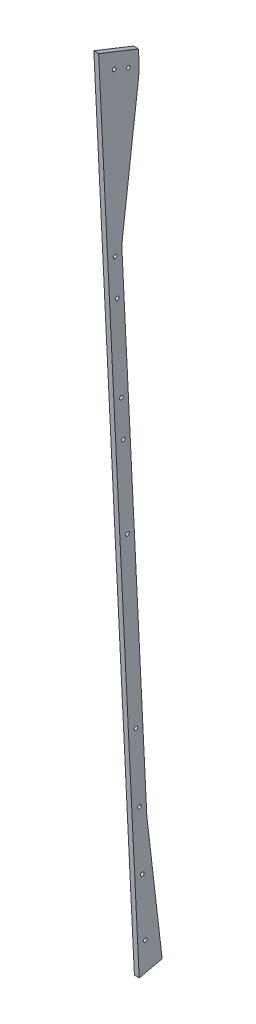
ISO-10303-21;
HEADER;
FILE_DESCRIPTION(('STEP AP214'),'2;1');
FILE_NAME('part.step','',(''),(''),'','','');
FILE_SCHEMA(('AUTOMOTIVE_DESIGN { 1 0 10303 214 1 1 1 1 }'));
ENDSEC;
DATA;
#1=APPLICATION_CONTEXT('core data for automotive mechanical design processes');
#2=APPLICATION_PROTOCOL_DEFINITION('international standard','automotive_design',2000,#1);
#3=PRODUCT_CONTEXT('',#1,'mechanical');
#4=PRODUCT('Part','Part','',(#3));
#5=PRODUCT_RELATED_PRODUCT_CATEGORY('part','',(#4));
#6=PRODUCT_DEFINITION_FORMATION('','',#4);
#7=PRODUCT_DEFINITION_CONTEXT('part definition',#1,'design');
#8=PRODUCT_DEFINITION('design','',#6,#7);
#9=PRODUCT_DEFINITION_SHAPE('','',#8);
#10=(LENGTH_UNIT() NAMED_UNIT(*) SI_UNIT(.MILLI.,.METRE.));
#11=(NAMED_UNIT(*) PLANE_ANGLE_UNIT() SI_UNIT($,.RADIAN.));
#12=(NAMED_UNIT(*) SI_UNIT($,.STERADIAN.) SOLID_ANGLE_UNIT());
#13=UNCERTAINTY_MEASURE_WITH_UNIT(LENGTH_MEASURE(1.E-05),#10,'distance_accuracy_value','');
#14=(GEOMETRIC_REPRESENTATION_CONTEXT(3) GLOBAL_UNCERTAINTY_ASSIGNED_CONTEXT((#13)) GLOBAL_UNIT_ASSIGNED_CONTEXT((#10,
#11,#12)) REPRESENTATION_CONTEXT('',''));
#15=CARTESIAN_POINT('',(0.,0.,0.));
#16=DIRECTION('',(0.,0.,1.));
#17=DIRECTION('',(1.,0.,0.));
#18=AXIS2_PLACEMENT_3D('',#15,#16,#17);
#19=CARTESIAN_POINT('',(330.833532998339,6328.56471667294,3286.55838001129));
#20=DIRECTION('',(-0.999638800759929,0.0267996972431761,0.00201103031422804));
#21=DIRECTION('',(-0.0267997514355835,-0.999640822157134,0.));
#22=AXIS2_PLACEMENT_3D('',#19,#20,#21);
#23=PLANE('',#22);
#24=CARTESIAN_POINT('',(345.118144193122,6858.71025908507,3322.21750066347));
#25=DIRECTION('',(-0.999638800759929,0.0267996972431761,0.00201103031422804));
#26=DIRECTION('',(-0.0267997514355835,-0.999640822157134,0.));
#27=AXIS2_PLACEMENT_3D('',#24,#25,#26);
#28=CIRCLE('',#27,4.21640000000019);
#29=CARTESIAN_POINT('',(345.005145721169,6854.49537352252,3322.21750066347));
#30=VERTEX_POINT('',#29);
#31=EDGE_CURVE('E674',#30,#30,#28,.T.);
#32=ORIENTED_EDGE('',*,*,#31,.F.);
#33=EDGE_LOOP('',(#32));
#34=FACE_BOUND('',#33,.T.);
#35=CARTESIAN_POINT('',(344.873476967481,6851.01357504661,3303.16753918493));
#36=DIRECTION('',(-0.999638800759929,0.0267996972431761,0.00201103031422804));
#37=DIRECTION('',(-0.0267997514355835,-0.999640822157134,0.));
#38=AXIS2_PLACEMENT_3D('',#35,#36,#37);
#39=CIRCLE('',#38,4.21640000000019);
#40=CARTESIAN_POINT('',(344.760478495528,6846.79868948406,3303.16753918493));
#41=VERTEX_POINT('',#40);
#42=EDGE_CURVE('E281',#41,#41,#39,.T.);
#43=ORIENTED_EDGE('',*,*,#42,.F.);
#44=EDGE_LOOP('',(#43));
#45=FACE_BOUND('',#44,.T.);
#46=CARTESIAN_POINT('',(339.165717767339,6637.23527592942,3314.85116795923));
#47=DIRECTION('',(-0.999638800759929,0.0267996972431761,0.00201103031422804));
#48=DIRECTION('',(-0.0267997514355835,-0.999640822157134,0.));
#49=AXIS2_PLACEMENT_3D('',#46,#47,#48);
#50=CIRCLE('',#49,4.21640000000019);
#51=CARTESIAN_POINT('',(339.052719295386,6633.02039036688,3314.85116795923));
#52=VERTEX_POINT('',#51);
#53=EDGE_CURVE('E274',#52,#52,#50,.T.);
#54=ORIENTED_EDGE('',*,*,#53,.F.);
#55=EDGE_LOOP('',(#54));
#56=FACE_BOUND('',#55,.T.);
#57=CARTESIAN_POINT('',(337.79643987231,6586.44668000312,3311.04002766538));
#58=DIRECTION('',(-0.999638800759929,0.0267996972431761,0.00201103031422804));
#59=DIRECTION('',(-0.0267997514355835,-0.999640822157134,0.));
#60=AXIS2_PLACEMENT_3D('',#57,#58,#59);
#61=CIRCLE('',#60,4.21640000000019);
#62=CARTESIAN_POINT('',(337.683441400357,6582.23179444058,3311.04002766538));
#63=VERTEX_POINT('',#62);
#64=EDGE_CURVE('E270',#63,#63,#61,.T.);
#65=ORIENTED_EDGE('',*,*,#64,.F.);
#66=EDGE_LOOP('',(#65));
#67=FACE_BOUND('',#66,.T.);
#68=CARTESIAN_POINT('',(334.559117433361,6466.36947592941,3302.02951925376));
#69=DIRECTION('',(-0.999638800759929,0.0267996972431761,0.00201103031422804));
#70=DIRECTION('',(-0.0267997514355835,-0.999640822157134,0.));
#71=AXIS2_PLACEMENT_3D('',#68,#69,#70);
#72=CIRCLE('',#71,4.21640000000019);
#73=CARTESIAN_POINT('',(334.446118961408,6462.15459036687,3302.02951925376));
#74=VERTEX_POINT('',#73);
#75=EDGE_CURVE('E266',#74,#74,#72,.T.);
#76=ORIENTED_EDGE('',*,*,#75,.F.);
#77=EDGE_LOOP('',(#76));
#78=FACE_BOUND('',#77,.T.);
#79=CARTESIAN_POINT('',(333.189839538871,6415.58088002313,3298.21837896142));
#80=DIRECTION('',(-0.999638800759929,0.0267996972431761,0.00201103031422804));
#81=DIRECTION('',(-0.0267997514355835,-0.999640822157134,0.));
#82=AXIS2_PLACEMENT_3D('',#79,#80,#81);
#83=CIRCLE('',#82,4.21640000000019);
#84=CARTESIAN_POINT('',(333.076841066918,6411.36599446059,3298.21837896142));
#85=VERTEX_POINT('',#84);
#86=EDGE_CURVE('E260',#85,#85,#83,.T.);
#87=ORIENTED_EDGE('',*,*,#86,.F.);
#88=EDGE_LOOP('',(#87));
#89=FACE_BOUND('',#88,.T.);
#90=CARTESIAN_POINT('',(330.107965047175,6301.2694763098,3289.64053212822));
#91=DIRECTION('',(-0.999638800759929,0.0267996972431761,0.00201103031422804));
#92=DIRECTION('',(-0.0267997514355835,-0.999640822157134,0.));
#93=AXIS2_PLACEMENT_3D('',#90,#91,#92);
#94=CIRCLE('',#93,4.21640000000019);
#95=CARTESIAN_POINT('',(329.994966575222,6297.05459074726,3289.64053212822));
#96=VERTEX_POINT('',#95);
#97=EDGE_CURVE('E254',#96,#96,#94,.T.);
#98=ORIENTED_EDGE('',*,*,#97,.F.);
#99=EDGE_LOOP('',(#98));
#100=FACE_BOUND('',#99,.T.);
#101=CARTESIAN_POINT('',(323.773940239033,6066.33088003518,3272.01090613637));
#102=DIRECTION('',(-0.999638800759929,0.0267996972431761,0.00201103031422804));
#103=DIRECTION('',(-0.0267997514355835,-0.999640822157134,0.));
#104=AXIS2_PLACEMENT_3D('',#101,#102,#103);
#105=CIRCLE('',#104,4.21640000000019);
#106=CARTESIAN_POINT('',(323.66094176708,6062.11599447264,3272.01090613637));
#107=VERTEX_POINT('',#106);
#108=EDGE_CURVE('E248',#107,#107,#105,.T.);
#109=ORIENTED_EDGE('',*,*,#108,.F.);
#110=EDGE_LOOP('',(#109));
#111=FACE_BOUND('',#110,.T.);
#112=CARTESIAN_POINT('',(321.205660263431,5971.06947664874,3264.86255784549));
#113=DIRECTION('',(-0.999638800759929,0.0267996972431761,0.00201103031422804));
#114=DIRECTION('',(-0.0267997514355835,-0.999640822157134,0.));
#115=AXIS2_PLACEMENT_3D('',#112,#113,#114);
#116=CIRCLE('',#115,4.21640000000019);
#117=CARTESIAN_POINT('',(321.092661791478,5966.8545910862,3264.86255784549));
#118=VERTEX_POINT('',#117);
#119=EDGE_CURVE('E242',#118,#118,#116,.T.);
#120=ORIENTED_EDGE('',*,*,#119,.F.);
#121=EDGE_LOOP('',(#120));
#122=FACE_BOUND('',#121,.T.);
#123=CARTESIAN_POINT('',(319.008412287028,5889.57021340304,3258.7469108109));
#124=DIRECTION('',(-0.999638800759929,0.0267996972431761,0.00201103031422804));
#125=DIRECTION('',(-0.0267997514355835,-0.999640822157134,0.));
#126=AXIS2_PLACEMENT_3D('',#123,#124,#125);
#127=CIRCLE('',#126,4.21640000000019);
#128=CARTESIAN_POINT('',(318.895413815075,5885.3553278405,3258.7469108109));
#129=VERTEX_POINT('',#128);
#130=EDGE_CURVE('E236',#129,#129,#127,.T.);
#131=ORIENTED_EDGE('',*,*,#130,.F.);
#132=EDGE_LOOP('',(#131));
#133=FACE_BOUND('',#132,.T.);
#134=CARTESIAN_POINT('',(316.858408729451,5809.82331737681,3252.76276017221));
#135=DIRECTION('',(-0.999638800759929,0.0267996972431761,0.00201103031422804));
#136=DIRECTION('',(-0.0267997514355835,-0.999640822157134,0.));
#137=AXIS2_PLACEMENT_3D('',#134,#135,#136);
#138=CIRCLE('',#137,4.21640000000019);
#139=CARTESIAN_POINT('',(316.745410257498,5805.60843181427,3252.76276017221));
#140=VERTEX_POINT('',#139);
#141=EDGE_CURVE('E230',#140,#140,#138,.T.);
#142=ORIENTED_EDGE('',*,*,#141,.F.);
#143=EDGE_LOOP('',(#142));
#144=FACE_BOUND('',#143,.T.);
#145=DIRECTION('',(-0.0268750444697445,-0.996836200329252,-0.0748018829835693));
#146=VECTOR('',#145,1.);
#147=CARTESIAN_POINT('',(345.257711916951,6866.31808677679,3290.20894948043));
#148=LINE('',#147,#146);
#149=CARTESIAN_POINT('',(345.257711916951,6866.31808677679,3290.20894948043));
#150=VERTEX_POINT('',#149);
#151=CARTESIAN_POINT('',(344.862153269152,6851.64621600378,3289.10798268132));
#152=VERTEX_POINT('',#151);
#153=EDGE_CURVE('E172',#150,#152,#148,.T.);
#154=ORIENTED_EDGE('',*,*,#153,.T.);
#155=CARTESIAN_POINT('',(344.862153269152,6842.14294429035,3415.75192381843));
#156=DIRECTION('',(-0.999638800759929,0.0267996972431761,0.00201103031422804));
#157=DIRECTION('',(-0.0267997514355835,-0.999640822157134,0.));
#158=AXIS2_PLACEMENT_3D('',#155,#156,#157);
#159=CIRCLE('',#158,127.);
#160=CARTESIAN_POINT('',(344.2920511811,6830.3667570707,3289.30036630261));
#161=VERTEX_POINT('',#160);
#162=EDGE_CURVE('E61',#152,#161,#159,.T.);
#163=ORIENTED_EDGE('',*,*,#162,.T.);
#164=DIRECTION('',(-0.0264974896682468,-0.995330943322221,0.0928126947490465));
#165=VECTOR('',#164,1.);
#166=CARTESIAN_POINT('',(344.575085787419,6840.99844728843,3288.30898165264));
#167=LINE('',#166,#165);
#168=CARTESIAN_POINT('',(339.676212974387,6656.98102679845,3305.46825193458));
#169=VERTEX_POINT('',#168);
#170=EDGE_CURVE('E337',#161,#169,#167,.T.);
#171=ORIENTED_EDGE('',*,*,#170,.T.);
#172=CARTESIAN_POINT('',(339.106110886335,6645.20483957881,3179.01669441876));
#173=DIRECTION('',(-0.999638800759929,0.0267996972431761,0.00201103031422804));
#174=DIRECTION('',(-0.0267997514355835,-0.999640822157134,0.));
#175=AXIS2_PLACEMENT_3D('',#172,#173,#174);
#176=CIRCLE('',#175,127.);
#177=CARTESIAN_POINT('',(339.106110886336,6635.70156786537,3305.66063555587));
#178=VERTEX_POINT('',#177);
#179=EDGE_CURVE('E53',#169,#178,#176,.F.);
#180=ORIENTED_EDGE('',*,*,#179,.T.);
#181=DIRECTION('',(-0.0268750444697426,-0.996836200329252,-0.0748018829835755));
#182=VECTOR('',#181,1.);
#183=CARTESIAN_POINT('',(320.7592161912,5955.18738987656,3254.5953332587));
#184=LINE('',#183,#182);
#185=CARTESIAN_POINT('',(320.869813105675,5959.28959733959,3254.90316000348));
#186=VERTEX_POINT('',#185);
#187=EDGE_CURVE('E141',#178,#186,#184,.T.);
#188=ORIENTED_EDGE('',*,*,#187,.T.);
#189=CARTESIAN_POINT('',(320.869813105675,5968.79286905303,3128.25921886636));
#190=DIRECTION('',(-0.999638800759929,0.0267996972431761,0.00201103031422804));
#191=DIRECTION('',(-0.0267997514355835,-0.999640822157134,0.));
#192=AXIS2_PLACEMENT_3D('',#189,#190,#191);
#193=CIRCLE('',#192,127.);
#194=CARTESIAN_POINT('',(320.648851281778,5951.11372335362,3254.02248450149));
#195=VERTEX_POINT('',#194);
#196=EDGE_CURVE('E135',#186,#195,#193,.F.);
#197=ORIENTED_EDGE('',*,*,#196,.T.);
#198=DIRECTION('',(-0.0268186672540606,-0.989900753371849,-0.139202218231466));
#199=VECTOR('',#198,1.);
#200=CARTESIAN_POINT('',(315.910060904877,5776.2007748567,3229.42580615243));
#201=LINE('',#200,#199);
#202=CARTESIAN_POINT('',(315.910060904877,5776.2007748567,3229.42580615243));
#203=VERTEX_POINT('',#202);
#204=EDGE_CURVE('E128',#195,#203,#201,.T.);
#205=ORIENTED_EDGE('',*,*,#204,.T.);
#206=DIRECTION('',(0.00407056898783209,0.22494919066946,-0.974361992323834));
#207=VECTOR('',#206,1.);
#208=CARTESIAN_POINT('',(315.783406950661,5769.20158025248,3259.74264872));
#209=LINE('',#208,#207);
#210=CARTESIAN_POINT('',(315.783406950661,5769.20158025248,3259.74264872));
#211=VERTEX_POINT('',#210);
#212=EDGE_CURVE('E132',#211,#203,#209,.T.);
#213=ORIENTED_EDGE('',*,*,#212,.F.);
#214=DIRECTION('',(-0.0268750444697409,-0.996836200329285,-0.0748018829831427));
#215=VECTOR('',#214,1.);
#216=CARTESIAN_POINT('',(345.944605360305,6887.92621916047,3343.69095387015));
#217=LINE('',#216,#215);
#218=CARTESIAN_POINT('',(345.944605360305,6887.92621916047,3343.69095387015));
#219=VERTEX_POINT('',#218);
#220=EDGE_CURVE('E190',#219,#211,#217,.T.);
#221=ORIENTED_EDGE('',*,*,#220,.F.);
#222=DIRECTION('',(0.0119073951331528,0.37458003547832,0.927118121364372));
#223=VECTOR('',#222,1.);
#224=CARTESIAN_POINT('',(345.260705407891,6866.41225531079,3290.44202478092));
#225=LINE('',#224,#223);
#226=EDGE_CURVE('E140',#150,#219,#225,.T.);
#227=ORIENTED_EDGE('',*,*,#226,.F.);
#228=EDGE_LOOP('',(#154,#163,#171,#180,#188,#197,#205,#213,#221,#227));
#229=FACE_BOUND('',#228,.T.);
#230=ADVANCED_FACE('F44',(#34,#45,#56,#67,#78,#89,#100,#111,#122,#133,#144,#229),#23,.T.);
#231=CARTESIAN_POINT('',(315.783406950661,5769.20158025248,3259.74264872));
#232=DIRECTION('',(-0.0265649860411408,-0.974001867475019,-0.224977029209229));
#233=DIRECTION('',(0.,0.225056454223439,-0.974345725301021));
#234=AXIS2_PLACEMENT_3D('',#231,#232,#233);
#235=PLANE('',#234);
#236=ORIENTED_EDGE('',*,*,#212,.T.);
#237=DIRECTION('',(-0.999638800759929,0.0267996972431761,0.00201103031422804));
#238=VECTOR('',#237,1.);
#239=CARTESIAN_POINT('',(1424.96732066379,5746.46763648283,3227.19465249183));
#240=LINE('',#239,#238);
#241=CARTESIAN_POINT('',(322.257767289702,5776.0305967792,3229.41303610994));
#242=VERTEX_POINT('',#241);
#243=EDGE_CURVE('E148',#242,#203,#240,.T.);
#244=ORIENTED_EDGE('',*,*,#243,.F.);
#245=DIRECTION('',(0.00407056898790203,0.224949190669511,-0.974361992323821));
#246=VECTOR('',#245,1.);
#247=CARTESIAN_POINT('',(322.131113335485,5769.03140217498,3259.72987867752));
#248=LINE('',#247,#246);
#249=CARTESIAN_POINT('',(322.131113335485,5769.03140217498,3259.72987867752));
#250=VERTEX_POINT('',#249);
#251=EDGE_CURVE('E173',#250,#242,#248,.T.);
#252=ORIENTED_EDGE('',*,*,#251,.F.);
#253=DIRECTION('',(-0.99963880075992,0.0267996972436962,0.0020110303120063));
#254=VECTOR('',#253,1.);
#255=CARTESIAN_POINT('',(322.131113335484,5769.03140217498,3259.72987867752));
#256=LINE('',#255,#254);
#257=EDGE_CURVE('E149',#250,#211,#256,.T.);
#258=ORIENTED_EDGE('',*,*,#257,.T.);
#259=EDGE_LOOP('',(#236,#244,#252,#258));
#260=FACE_BOUND('',#259,.T.);
#261=ADVANCED_FACE('F146',(#260),#235,.T.);
#262=CARTESIAN_POINT('',(337.18123938317,6328.39453859544,3286.54560996879));
#263=DIRECTION('',(0.999638800759929,-0.0267996972431899,-0.00201103031419884));
#264=DIRECTION('',(0.0267997514355972,0.999640822157134,0.));
#265=AXIS2_PLACEMENT_3D('',#262,#263,#264);
#266=PLANE('',#265);
#267=CARTESIAN_POINT('',(351.46585057796,6858.54008100757,3322.20473062097));
#268=DIRECTION('',(0.999638800759929,-0.0267996972431899,-0.00201103031419884));
#269=DIRECTION('',(0.0267997514355972,0.999640822157134,0.));
#270=AXIS2_PLACEMENT_3D('',#267,#268,#269);
#271=CIRCLE('',#270,2.45745000000005);
#272=CARTESIAN_POINT('',(351.531709627125,6860.99664834598,3322.20473062097));
#273=VERTEX_POINT('',#272);
#274=EDGE_CURVE('E48',#273,#273,#271,.T.);
#275=ORIENTED_EDGE('',*,*,#274,.F.);
#276=EDGE_LOOP('',(#275));
#277=FACE_BOUND('',#276,.T.);
#278=CARTESIAN_POINT('',(351.221183352319,6850.84339696911,3303.15476914244));
#279=DIRECTION('',(0.999638800759929,-0.0267996972431899,-0.00201103031419884));
#280=DIRECTION('',(0.0267997514355972,0.999640822157134,0.));
#281=AXIS2_PLACEMENT_3D('',#278,#279,#280);
#282=CIRCLE('',#281,2.45745000000005);
#283=CARTESIAN_POINT('',(351.287042401484,6853.29996430752,3303.15476914244));
#284=VERTEX_POINT('',#283);
#285=EDGE_CURVE('E272',#284,#284,#282,.T.);
#286=ORIENTED_EDGE('',*,*,#285,.F.);
#287=EDGE_LOOP('',(#286));
#288=FACE_BOUND('',#287,.T.);
#289=CARTESIAN_POINT('',(345.513424152173,6637.06509785193,3314.83839791673));
#290=DIRECTION('',(0.999638800759929,-0.0267996972431899,-0.00201103031419884));
#291=DIRECTION('',(0.0267997514355972,0.999640822157134,0.));
#292=AXIS2_PLACEMENT_3D('',#289,#290,#291);
#293=CIRCLE('',#292,2.45745000000005);
#294=CARTESIAN_POINT('',(345.579283201339,6639.52166519034,3314.83839791673));
#295=VERTEX_POINT('',#294);
#296=EDGE_CURVE('E268',#295,#295,#293,.T.);
#297=ORIENTED_EDGE('',*,*,#296,.F.);
#298=EDGE_LOOP('',(#297));
#299=FACE_BOUND('',#298,.T.);
#300=CARTESIAN_POINT('',(344.144146257144,6586.27650192562,3311.02725762289));
#301=DIRECTION('',(0.999638800759929,-0.0267996972431899,-0.00201103031419884));
#302=DIRECTION('',(0.0267997514355972,0.999640822157134,0.));
#303=AXIS2_PLACEMENT_3D('',#300,#301,#302);
#304=CIRCLE('',#303,2.45745000000005);
#305=CARTESIAN_POINT('',(344.210005306309,6588.73306926404,3311.02725762289));
#306=VERTEX_POINT('',#305);
#307=EDGE_CURVE('E262',#306,#306,#304,.T.);
#308=ORIENTED_EDGE('',*,*,#307,.F.);
#309=EDGE_LOOP('',(#308));
#310=FACE_BOUND('',#309,.T.);
#311=CARTESIAN_POINT('',(340.906823818193,6466.19929785192,3302.01674921127));
#312=DIRECTION('',(0.999638800759929,-0.0267996972431899,-0.00201103031419884));
#313=DIRECTION('',(0.0267997514355972,0.999640822157134,0.));
#314=AXIS2_PLACEMENT_3D('',#311,#312,#313);
#315=CIRCLE('',#314,2.45745000000005);
#316=CARTESIAN_POINT('',(340.972682867359,6468.65586519033,3302.01674921127));
#317=VERTEX_POINT('',#316);
#318=EDGE_CURVE('E256',#317,#317,#315,.T.);
#319=ORIENTED_EDGE('',*,*,#318,.F.);
#320=EDGE_LOOP('',(#319));
#321=FACE_BOUND('',#320,.T.);
#322=CARTESIAN_POINT('',(339.537545923703,6415.41070194563,3298.20560891892));
#323=DIRECTION('',(0.999638800759929,-0.0267996972431899,-0.00201103031419884));
#324=DIRECTION('',(0.0267997514355972,0.999640822157134,0.));
#325=AXIS2_PLACEMENT_3D('',#322,#323,#324);
#326=CIRCLE('',#325,2.45745000000005);
#327=CARTESIAN_POINT('',(339.603404972869,6417.86726928404,3298.20560891892));
#328=VERTEX_POINT('',#327);
#329=EDGE_CURVE('E250',#328,#328,#326,.T.);
#330=ORIENTED_EDGE('',*,*,#329,.F.);
#331=EDGE_LOOP('',(#330));
#332=FACE_BOUND('',#331,.T.);
#333=CARTESIAN_POINT('',(336.455671432006,6301.09929823231,3289.62776208573));
#334=DIRECTION('',(0.999638800759929,-0.0267996972431899,-0.00201103031419884));
#335=DIRECTION('',(0.0267997514355972,0.999640822157134,0.));
#336=AXIS2_PLACEMENT_3D('',#333,#334,#335);
#337=CIRCLE('',#336,2.45745000000005);
#338=CARTESIAN_POINT('',(336.521530481171,6303.55586557072,3289.62776208573));
#339=VERTEX_POINT('',#338);
#340=EDGE_CURVE('E244',#339,#339,#337,.T.);
#341=ORIENTED_EDGE('',*,*,#340,.F.);
#342=EDGE_LOOP('',(#341));
#343=FACE_BOUND('',#342,.T.);
#344=CARTESIAN_POINT('',(330.121646623861,6066.16070195769,3271.99813609388));
#345=DIRECTION('',(0.999638800759929,-0.0267996972431899,-0.00201103031419884));
#346=DIRECTION('',(0.0267997514355972,0.999640822157134,0.));
#347=AXIS2_PLACEMENT_3D('',#344,#345,#346);
#348=CIRCLE('',#347,2.45745000000005);
#349=CARTESIAN_POINT('',(330.187505673026,6068.6172692961,3271.99813609388));
#350=VERTEX_POINT('',#349);
#351=EDGE_CURVE('E238',#350,#350,#348,.T.);
#352=ORIENTED_EDGE('',*,*,#351,.F.);
#353=EDGE_LOOP('',(#352));
#354=FACE_BOUND('',#353,.T.);
#355=CARTESIAN_POINT('',(327.553366648258,5970.89929857125,3264.849787803));
#356=DIRECTION('',(0.999638800759929,-0.0267996972431899,-0.00201103031419884));
#357=DIRECTION('',(0.0267997514355972,0.999640822157134,0.));
#358=AXIS2_PLACEMENT_3D('',#355,#356,#357);
#359=CIRCLE('',#358,2.45745000000005);
#360=CARTESIAN_POINT('',(327.619225697424,5973.35586590966,3264.849787803));
#361=VERTEX_POINT('',#360);
#362=EDGE_CURVE('E232',#361,#361,#359,.T.);
#363=ORIENTED_EDGE('',*,*,#362,.F.);
#364=EDGE_LOOP('',(#363));
#365=FACE_BOUND('',#364,.T.);
#366=CARTESIAN_POINT('',(325.356118671854,5889.40003532555,3258.7341407684));
#367=DIRECTION('',(0.999638800759929,-0.0267996972431899,-0.00201103031419884));
#368=DIRECTION('',(0.0267997514355972,0.999640822157134,0.));
#369=AXIS2_PLACEMENT_3D('',#366,#367,#368);
#370=CIRCLE('',#369,2.45745000000005);
#371=CARTESIAN_POINT('',(325.421977721019,5891.85660266396,3258.7341407684));
#372=VERTEX_POINT('',#371);
#373=EDGE_CURVE('E227',#372,#372,#370,.T.);
#374=ORIENTED_EDGE('',*,*,#373,.F.);
#375=EDGE_LOOP('',(#374));
#376=FACE_BOUND('',#375,.T.);
#377=CARTESIAN_POINT('',(323.206115114276,5809.65313929932,3252.74999012972));
#378=DIRECTION('',(0.999638800759929,-0.0267996972431899,-0.00201103031419884));
#379=DIRECTION('',(0.0267997514355972,0.999640822157134,0.));
#380=AXIS2_PLACEMENT_3D('',#377,#378,#379);
#381=CIRCLE('',#380,2.45745000000005);
#382=CARTESIAN_POINT('',(323.271974163441,5812.10970663773,3252.74999012972));
#383=VERTEX_POINT('',#382);
#384=EDGE_CURVE('E163',#383,#383,#381,.T.);
#385=ORIENTED_EDGE('',*,*,#384,.F.);
#386=EDGE_LOOP('',(#385));
#387=FACE_BOUND('',#386,.T.);
#388=DIRECTION('',(-0.0264974896682633,-0.99533094332222,0.0928126947490466));
#389=VECTOR('',#388,1.);
#390=CARTESIAN_POINT('',(350.922792172258,6840.82826921096,3288.29621161015));
#391=LINE('',#390,#389);
#392=CARTESIAN_POINT('',(350.639757565938,6830.1965789932,3289.28759626011));
#393=VERTEX_POINT('',#392);
#394=CARTESIAN_POINT('',(346.023919359222,6656.81084872096,3305.45548189209));
#395=VERTEX_POINT('',#394);
#396=EDGE_CURVE('E160',#393,#395,#391,.T.);
#397=ORIENTED_EDGE('',*,*,#396,.F.);
#398=CARTESIAN_POINT('',(351.209859653987,6841.97276621285,3415.73915377593));
#399=DIRECTION('',(0.999638800759929,-0.0267996972431899,-0.00201103031419884));
#400=DIRECTION('',(0.0267997514355972,0.999640822157134,0.));
#401=AXIS2_PLACEMENT_3D('',#398,#399,#400);
#402=CIRCLE('',#401,127.);
#403=CARTESIAN_POINT('',(351.20985965399,6851.47603792629,3289.09521263882));
#404=VERTEX_POINT('',#403);
#405=EDGE_CURVE('E69',#393,#404,#402,.T.);
#406=ORIENTED_EDGE('',*,*,#405,.T.);
#407=DIRECTION('',(-0.0268750444697542,-0.996836200329252,-0.0748018829835693));
#408=VECTOR('',#407,1.);
#409=CARTESIAN_POINT('',(351.60541830179,6866.14790869931,3290.19617943793));
#410=LINE('',#409,#408);
#411=CARTESIAN_POINT('',(351.605418301789,6866.1479086993,3290.19617943793));
#412=VERTEX_POINT('',#411);
#413=EDGE_CURVE('E167',#412,#404,#410,.T.);
#414=ORIENTED_EDGE('',*,*,#413,.F.);
#415=DIRECTION('',(0.011907395133137,0.374580035478111,0.927118121364457));
#416=VECTOR('',#415,1.);
#417=CARTESIAN_POINT('',(351.608411792731,6866.24207723329,3290.42925473841));
#418=LINE('',#417,#416);
#419=CARTESIAN_POINT('',(352.292311745144,6887.75604108297,3343.67818382766));
#420=VERTEX_POINT('',#419);
#421=EDGE_CURVE('E180',#412,#420,#418,.T.);
#422=ORIENTED_EDGE('',*,*,#421,.T.);
#423=DIRECTION('',(-0.0268750444697542,-0.996836200329284,-0.074801882983143));
#424=VECTOR('',#423,1.);
#425=CARTESIAN_POINT('',(352.292311745144,6887.75604108297,3343.67818382767));
#426=LINE('',#425,#424);
#427=EDGE_CURVE('E176',#420,#250,#426,.T.);
#428=ORIENTED_EDGE('',*,*,#427,.T.);
#429=ORIENTED_EDGE('',*,*,#251,.T.);
#430=DIRECTION('',(-0.0268186672540702,-0.989900753371849,-0.139202218231466));
#431=VECTOR('',#430,1.);
#432=CARTESIAN_POINT('',(322.257767289702,5776.03059677921,3229.41303610994));
#433=LINE('',#432,#431);
#434=CARTESIAN_POINT('',(326.996557666605,5950.94354527613,3254.00971445899));
#435=VERTEX_POINT('',#434);
#436=EDGE_CURVE('E154',#435,#242,#433,.T.);
#437=ORIENTED_EDGE('',*,*,#436,.F.);
#438=CARTESIAN_POINT('',(327.217519490505,5968.62269097554,3128.24644882387));
#439=DIRECTION('',(0.999638800759929,-0.0267996972431899,-0.00201103031419884));
#440=DIRECTION('',(0.0267997514355972,0.999640822157134,0.));
#441=AXIS2_PLACEMENT_3D('',#438,#439,#440);
#442=CIRCLE('',#441,127.);
#443=CARTESIAN_POINT('',(327.217519490502,5959.1194192621,3254.89038996098));
#444=VERTEX_POINT('',#443);
#445=EDGE_CURVE('E220',#435,#444,#442,.F.);
#446=ORIENTED_EDGE('',*,*,#445,.T.);
#447=DIRECTION('',(-0.0268750444697542,-0.996836200329252,-0.0748018829835754));
#448=VECTOR('',#447,1.);
#449=CARTESIAN_POINT('',(327.106922576027,5955.01721179908,3254.5825632162));
#450=LINE('',#449,#448);
#451=CARTESIAN_POINT('',(345.45381727117,6635.53138978788,3305.64786551338));
#452=VERTEX_POINT('',#451);
#453=EDGE_CURVE('E156',#452,#444,#450,.T.);
#454=ORIENTED_EDGE('',*,*,#453,.F.);
#455=CARTESIAN_POINT('',(345.453817271174,6645.03466150131,3179.00392437627));
#456=DIRECTION('',(0.999638800759929,-0.0267996972431899,-0.00201103031419884));
#457=DIRECTION('',(0.0267997514355972,0.999640822157134,0.));
#458=AXIS2_PLACEMENT_3D('',#455,#456,#457);
#459=CIRCLE('',#458,127.);
#460=EDGE_CURVE('E11',#452,#395,#459,.F.);
#461=ORIENTED_EDGE('',*,*,#460,.T.);
#462=EDGE_LOOP('',(#397,#406,#414,#422,#428,#429,#437,#446,#454,#461));
#463=FACE_BOUND('',#462,.T.);
#464=ADVANCED_FACE('F349',(#277,#288,#299,#310,#321,#332,#343,#354,#365,#376,#387,#463),#266,.T.);
#465=CARTESIAN_POINT('',(345.260705407891,6866.41225531079,3290.44202478092));
#466=DIRECTION('',(0.0240931931547996,0.926807193136058,-0.374763852038677));
#467=DIRECTION('',(0.,0.374872671243667,0.927076307730188));
#468=AXIS2_PLACEMENT_3D('',#465,#466,#467);
#469=PLANE('',#468);
#470=ORIENTED_EDGE('',*,*,#421,.F.);
#471=DIRECTION('',(-0.999638800759929,0.0267996972431761,0.00201103031422804));
#472=VECTOR('',#471,1.);
#473=CARTESIAN_POINT('',(1454.31497167586,6836.58494840292,3287.97779581983));
#474=LINE('',#473,#472);
#475=EDGE_CURVE('E169',#412,#150,#474,.T.);
#476=ORIENTED_EDGE('',*,*,#475,.T.);
#477=ORIENTED_EDGE('',*,*,#226,.T.);
#478=DIRECTION('',(-0.999638800759916,0.0267996972436856,0.00201103031424343));
#479=VECTOR('',#478,1.);
#480=CARTESIAN_POINT('',(352.292311745131,6887.75604108297,3343.67818382765));
#481=LINE('',#480,#479);
#482=EDGE_CURVE('E150',#420,#219,#481,.T.);
#483=ORIENTED_EDGE('',*,*,#482,.F.);
#484=EDGE_LOOP('',(#470,#476,#477,#483));
#485=FACE_BOUND('',#484,.T.);
#486=ADVANCED_FACE('F358',(#485),#469,.T.);
#487=CARTESIAN_POINT('',(345.944605360305,6887.92621916047,3343.69095387015));
#488=DIRECTION('',(0.,-0.0748289111289773,0.997196386906437));
#489=DIRECTION('',(0.,-0.997196386906437,-0.0748289111289773));
#490=AXIS2_PLACEMENT_3D('',#487,#488,#489);
#491=PLANE('',#490);
#492=ORIENTED_EDGE('',*,*,#427,.F.);
#493=ORIENTED_EDGE('',*,*,#482,.T.);
#494=ORIENTED_EDGE('',*,*,#220,.T.);
#495=ORIENTED_EDGE('',*,*,#257,.F.);
#496=EDGE_LOOP('',(#492,#493,#494,#495));
#497=FACE_BOUND('',#496,.T.);
#498=ADVANCED_FACE('F361',(#497),#491,.T.);
#499=CARTESIAN_POINT('',(1424.96732066379,5746.46763648283,3227.19465249183));
#500=DIRECTION('',(0.00173985688107386,0.13920587164886,-0.99026193413486));
#501=DIRECTION('',(0.,0.990263432950187,0.139206082344522));
#502=AXIS2_PLACEMENT_3D('',#499,#500,#501);
#503=PLANE('',#502);
#504=ORIENTED_EDGE('',*,*,#204,.F.);
#505=DIRECTION('',(-0.999638800759929,0.0267996972431761,0.00201103031422804));
#506=VECTOR('',#505,1.);
#507=CARTESIAN_POINT('',(326.996557666605,5950.94354527613,3254.00971445899));
#508=LINE('',#507,#506);
#509=EDGE_CURVE('E206',#195,#435,#508,.F.);
#510=ORIENTED_EDGE('',*,*,#509,.T.);
#511=ORIENTED_EDGE('',*,*,#436,.T.);
#512=ORIENTED_EDGE('',*,*,#243,.T.);
#513=EDGE_LOOP('',(#504,#510,#511,#512));
#514=FACE_BOUND('',#513,.T.);
#515=ADVANCED_FACE('F152',(#514),#503,.T.);
#516=CARTESIAN_POINT('',(1429.81647595011,5925.45425150269,3252.3641795981));
#517=DIRECTION('',(0.,0.0748289111294108,-0.997196386906404));
#518=DIRECTION('',(0.,0.997196386906404,0.0748289111294108));
#519=AXIS2_PLACEMENT_3D('',#516,#517,#518);
#520=PLANE('',#519);
#521=ORIENTED_EDGE('',*,*,#453,.T.);
#522=DIRECTION('',(-0.999638800759929,0.0267996972431761,0.00201103031422804));
#523=VECTOR('',#522,1.);
#524=CARTESIAN_POINT('',(320.869813105675,5959.28959733959,3254.90316000348));
#525=LINE('',#524,#523);
#526=EDGE_CURVE('E202',#444,#186,#525,.T.);
#527=ORIENTED_EDGE('',*,*,#526,.T.);
#528=ORIENTED_EDGE('',*,*,#187,.F.);
#529=DIRECTION('',(-0.999638800759929,0.0267996972431761,0.00201103031422804));
#530=VECTOR('',#529,1.);
#531=CARTESIAN_POINT('',(345.453817271171,6635.53138978788,3305.64786551338));
#532=LINE('',#531,#530);
#533=EDGE_CURVE('E175',#178,#452,#532,.F.);
#534=ORIENTED_EDGE('',*,*,#533,.T.);
#535=EDGE_LOOP('',(#521,#527,#528,#534));
#536=FACE_BOUND('',#535,.T.);
#537=ADVANCED_FACE('F372',(#536),#520,.T.);
#538=CARTESIAN_POINT('',(1453.63234554633,6811.26530891456,3286.07782799205));
#539=DIRECTION('',(-0.00448899281930795,-0.0927258836192605,-0.995681555242687));
#540=DIRECTION('',(0.,0.99569158741196,-0.0927268178956419));
#541=AXIS2_PLACEMENT_3D('',#538,#539,#540);
#542=PLANE('',#541);
#543=ORIENTED_EDGE('',*,*,#396,.T.);
#544=DIRECTION('',(-0.999638800759929,0.0267996972431761,0.00201103031422804));
#545=VECTOR('',#544,1.);
#546=CARTESIAN_POINT('',(339.676212974388,6656.98102679845,3305.46825193458));
#547=LINE('',#546,#545);
#548=EDGE_CURVE('E211',#395,#169,#547,.T.);
#549=ORIENTED_EDGE('',*,*,#548,.T.);
#550=ORIENTED_EDGE('',*,*,#170,.F.);
#551=DIRECTION('',(-0.999638800759929,0.0267996972431761,0.00201103031422804));
#552=VECTOR('',#551,1.);
#553=CARTESIAN_POINT('',(1453.34931094001,6800.63361869683,3287.06921264201));
#554=LINE('',#553,#552);
#555=EDGE_CURVE('E209',#161,#393,#554,.F.);
#556=ORIENTED_EDGE('',*,*,#555,.T.);
#557=EDGE_LOOP('',(#543,#549,#550,#556));
#558=FACE_BOUND('',#557,.T.);
#559=ADVANCED_FACE('F348',(#558),#542,.T.);
#560=CARTESIAN_POINT('',(1454.31497167586,6836.58494840292,3287.97779581983));
#561=DIRECTION('',(0.,0.0748289111294047,-0.997196386906405));
#562=DIRECTION('',(0.,0.997196386906405,0.0748289111294047));
#563=AXIS2_PLACEMENT_3D('',#560,#561,#562);
#564=PLANE('',#563);
#565=ORIENTED_EDGE('',*,*,#413,.T.);
#566=DIRECTION('',(-0.999638800759929,0.0267996972431761,0.00201103031422804));
#567=VECTOR('',#566,1.);
#568=CARTESIAN_POINT('',(1453.91941302807,6821.91307762991,3286.87682902072));
#569=LINE('',#568,#567);
#570=EDGE_CURVE('E214',#404,#152,#569,.T.);
#571=ORIENTED_EDGE('',*,*,#570,.T.);
#572=ORIENTED_EDGE('',*,*,#153,.F.);
#573=ORIENTED_EDGE('',*,*,#475,.F.);
#574=EDGE_LOOP('',(#565,#571,#572,#573));
#575=FACE_BOUND('',#574,.T.);
#576=ADVANCED_FACE('F345',(#575),#564,.T.);
#577=CARTESIAN_POINT('',(1429.92707286459,5939.05973067916,3126.02806520577));
#578=DIRECTION('',(0.999638800759929,-0.0267996972431761,-0.00201103031422804));
#579=DIRECTION('',(0.0267997514355835,0.999640822157134,0.));
#580=AXIS2_PLACEMENT_3D('',#577,#578,#579);
#581=CYLINDRICAL_SURFACE('',#580,127.);
#582=ORIENTED_EDGE('',*,*,#445,.F.);
#583=ORIENTED_EDGE('',*,*,#509,.F.);
#584=ORIENTED_EDGE('',*,*,#196,.F.);
#585=ORIENTED_EDGE('',*,*,#526,.F.);
#586=EDGE_LOOP('',(#582,#583,#584,#585));
#587=FACE_BOUND('',#586,.T.);
#588=ADVANCED_FACE('F388',(#587),#581,.F.);
#589=CARTESIAN_POINT('',(1448.16337064525,6615.47170120493,3176.78554075816));
#590=DIRECTION('',(0.999638800759929,-0.0267996972431761,-0.00201103031422804));
#591=DIRECTION('',(0.0267997514355835,0.999640822157134,0.));
#592=AXIS2_PLACEMENT_3D('',#589,#590,#591);
#593=CYLINDRICAL_SURFACE('',#592,127.);
#594=ORIENTED_EDGE('',*,*,#460,.F.);
#595=ORIENTED_EDGE('',*,*,#533,.F.);
#596=ORIENTED_EDGE('',*,*,#179,.F.);
#597=ORIENTED_EDGE('',*,*,#548,.F.);
#598=EDGE_LOOP('',(#594,#595,#596,#597));
#599=FACE_BOUND('',#598,.T.);
#600=ADVANCED_FACE('F354',(#599),#593,.F.);
#601=CARTESIAN_POINT('',(1453.91941302807,6812.40980591647,3413.52077015783));
#602=DIRECTION('',(-0.999638800759929,0.0267996972431761,0.00201103031422804));
#603=DIRECTION('',(-0.0267997514355835,-0.999640822157134,0.));
#604=AXIS2_PLACEMENT_3D('',#601,#602,#603);
#605=CYLINDRICAL_SURFACE('',#604,127.);
#606=ORIENTED_EDGE('',*,*,#405,.F.);
#607=ORIENTED_EDGE('',*,*,#555,.F.);
#608=ORIENTED_EDGE('',*,*,#162,.F.);
#609=ORIENTED_EDGE('',*,*,#570,.F.);
#610=EDGE_LOOP('',(#606,#607,#608,#609));
#611=FACE_BOUND('',#610,.T.);
#612=ADVANCED_FACE('F46',(#611),#605,.T.);
#613=CARTESIAN_POINT('',(316.858408729451,5809.82331737681,3252.76276017221));
#614=DIRECTION('',(-0.999638800759929,0.0267996972431761,0.00201103031422804));
#615=DIRECTION('',(-0.0267997514355835,-0.999640822157134,0.));
#616=AXIS2_PLACEMENT_3D('',#613,#614,#615);
#617=CYLINDRICAL_SURFACE('',#616,2.45745000000005);
#618=ORIENTED_EDGE('',*,*,#384,.T.);
#619=EDGE_LOOP('',(#618));
#620=FACE_BOUND('',#619,.T.);
#621=CARTESIAN_POINT('',(318.333809919364,5809.78376278452,3252.7597920236));
#622=DIRECTION('',(-0.999638800759929,0.0267996972431761,0.00201103031422804));
#623=DIRECTION('',(-0.0267997514355835,-0.999640822157134,0.));
#624=AXIS2_PLACEMENT_3D('',#621,#622,#623);
#625=CIRCLE('',#624,2.45745000000001);
#626=CARTESIAN_POINT('',(318.267950870199,5807.32719544611,3252.7597920236));
#627=VERTEX_POINT('',#626);
#628=EDGE_CURVE('E226',#627,#627,#625,.T.);
#629=ORIENTED_EDGE('',*,*,#628,.T.);
#630=EDGE_LOOP('',(#629));
#631=FACE_BOUND('',#630,.T.);
#632=ADVANCED_FACE('F395',(#620,#631),#617,.F.);
#633=CARTESIAN_POINT('',(316.858408729451,5809.82331737681,3252.76276017221));
#634=DIRECTION('',(-0.999638800759929,0.0267996972431761,0.00201103031422804));
#635=DIRECTION('',(-0.0267997514355835,-0.999640822157134,0.));
#636=AXIS2_PLACEMENT_3D('',#633,#634,#635);
#637=CONICAL_SURFACE('',#636,4.21640000000019,0.872664625997205);
#638=ORIENTED_EDGE('',*,*,#628,.F.);
#639=EDGE_LOOP('',(#638));
#640=FACE_BOUND('',#639,.T.);
#641=ORIENTED_EDGE('',*,*,#141,.T.);
#642=EDGE_LOOP('',(#641));
#643=FACE_BOUND('',#642,.T.);
#644=ADVANCED_FACE('F399',(#640,#643),#637,.F.);
#645=CARTESIAN_POINT('',(319.008412287028,5889.57021340304,3258.7469108109));
#646=DIRECTION('',(-0.999638800759929,0.0267996972431761,0.00201103031422804));
#647=DIRECTION('',(-0.0267997514355835,-0.999640822157134,0.));
#648=AXIS2_PLACEMENT_3D('',#645,#646,#647);
#649=CYLINDRICAL_SURFACE('',#648,2.45745000000005);
#650=ORIENTED_EDGE('',*,*,#373,.T.);
#651=EDGE_LOOP('',(#650));
#652=FACE_BOUND('',#651,.T.);
#653=CARTESIAN_POINT('',(320.483813476941,5889.53065881075,3258.74394266229));
#654=DIRECTION('',(-0.999638800759929,0.0267996972431761,0.00201103031422804));
#655=DIRECTION('',(-0.0267997514355835,-0.999640822157134,0.));
#656=AXIS2_PLACEMENT_3D('',#653,#654,#655);
#657=CIRCLE('',#656,2.45745000000001);
#658=CARTESIAN_POINT('',(320.417954427775,5887.07409147234,3258.74394266229));
#659=VERTEX_POINT('',#658);
#660=EDGE_CURVE('E231',#659,#659,#657,.T.);
#661=ORIENTED_EDGE('',*,*,#660,.T.);
#662=EDGE_LOOP('',(#661));
#663=FACE_BOUND('',#662,.T.);
#664=ADVANCED_FACE('F405',(#652,#663),#649,.F.);
#665=CARTESIAN_POINT('',(319.008412287028,5889.57021340304,3258.7469108109));
#666=DIRECTION('',(-0.999638800759929,0.0267996972431761,0.00201103031422804));
#667=DIRECTION('',(-0.0267997514355835,-0.999640822157134,0.));
#668=AXIS2_PLACEMENT_3D('',#665,#666,#667);
#669=CONICAL_SURFACE('',#668,4.21640000000019,0.872664625997205);
#670=ORIENTED_EDGE('',*,*,#660,.F.);
#671=EDGE_LOOP('',(#670));
#672=FACE_BOUND('',#671,.T.);
#673=ORIENTED_EDGE('',*,*,#130,.T.);
#674=EDGE_LOOP('',(#673));
#675=FACE_BOUND('',#674,.T.);
#676=ADVANCED_FACE('F477',(#672,#675),#669,.F.);
#677=CARTESIAN_POINT('',(321.205660263431,5971.06947664874,3264.86255784549));
#678=DIRECTION('',(-0.999638800759929,0.0267996972431761,0.00201103031422804));
#679=DIRECTION('',(-0.0267997514355835,-0.999640822157134,0.));
#680=AXIS2_PLACEMENT_3D('',#677,#678,#679);
#681=CYLINDRICAL_SURFACE('',#680,2.45745000000005);
#682=ORIENTED_EDGE('',*,*,#362,.T.);
#683=EDGE_LOOP('',(#682));
#684=FACE_BOUND('',#683,.T.);
#685=CARTESIAN_POINT('',(322.681061453344,5971.02992205645,3264.85958969688));
#686=DIRECTION('',(-0.999638800759929,0.0267996972431761,0.00201103031422804));
#687=DIRECTION('',(-0.0267997514355835,-0.999640822157134,0.));
#688=AXIS2_PLACEMENT_3D('',#685,#686,#687);
#689=CIRCLE('',#688,2.45745000000001);
#690=CARTESIAN_POINT('',(322.615202404179,5968.57335471804,3264.85958969688));
#691=VERTEX_POINT('',#690);
#692=EDGE_CURVE('E237',#691,#691,#689,.T.);
#693=ORIENTED_EDGE('',*,*,#692,.T.);
#694=EDGE_LOOP('',(#693));
#695=FACE_BOUND('',#694,.T.);
#696=ADVANCED_FACE('F486',(#684,#695),#681,.F.);
#697=CARTESIAN_POINT('',(321.205660263431,5971.06947664874,3264.86255784549));
#698=DIRECTION('',(-0.999638800759929,0.0267996972431761,0.00201103031422804));
#699=DIRECTION('',(-0.0267997514355835,-0.999640822157134,0.));
#700=AXIS2_PLACEMENT_3D('',#697,#698,#699);
#701=CONICAL_SURFACE('',#700,4.21640000000019,0.872664625997205);
#702=ORIENTED_EDGE('',*,*,#692,.F.);
#703=EDGE_LOOP('',(#702));
#704=FACE_BOUND('',#703,.T.);
#705=ORIENTED_EDGE('',*,*,#119,.T.);
#706=EDGE_LOOP('',(#705));
#707=FACE_BOUND('',#706,.T.);
#708=ADVANCED_FACE('F496',(#704,#707),#701,.F.);
#709=CARTESIAN_POINT('',(323.773940239033,6066.33088003518,3272.01090613637));
#710=DIRECTION('',(-0.999638800759929,0.0267996972431761,0.00201103031422804));
#711=DIRECTION('',(-0.0267997514355835,-0.999640822157134,0.));
#712=AXIS2_PLACEMENT_3D('',#709,#710,#711);
#713=CYLINDRICAL_SURFACE('',#712,2.45745000000005);
#714=ORIENTED_EDGE('',*,*,#351,.T.);
#715=EDGE_LOOP('',(#714));
#716=FACE_BOUND('',#715,.T.);
#717=CARTESIAN_POINT('',(325.249341428946,6066.29132544289,3272.00793798776));
#718=DIRECTION('',(-0.999638800759929,0.0267996972431761,0.00201103031422804));
#719=DIRECTION('',(-0.0267997514355835,-0.999640822157134,0.));
#720=AXIS2_PLACEMENT_3D('',#717,#718,#719);
#721=CIRCLE('',#720,2.45745000000001);
#722=CARTESIAN_POINT('',(325.183482379781,6063.83475810448,3272.00793798776));
#723=VERTEX_POINT('',#722);
#724=EDGE_CURVE('E243',#723,#723,#721,.T.);
#725=ORIENTED_EDGE('',*,*,#724,.T.);
#726=EDGE_LOOP('',(#725));
#727=FACE_BOUND('',#726,.T.);
#728=ADVANCED_FACE('F506',(#716,#727),#713,.F.);
#729=CARTESIAN_POINT('',(323.773940239033,6066.33088003518,3272.01090613637));
#730=DIRECTION('',(-0.999638800759929,0.0267996972431761,0.00201103031422804));
#731=DIRECTION('',(-0.0267997514355835,-0.999640822157134,0.));
#732=AXIS2_PLACEMENT_3D('',#729,#730,#731);
#733=CONICAL_SURFACE('',#732,4.21640000000019,0.872664625997205);
#734=ORIENTED_EDGE('',*,*,#724,.F.);
#735=EDGE_LOOP('',(#734));
#736=FACE_BOUND('',#735,.T.);
#737=ORIENTED_EDGE('',*,*,#108,.T.);
#738=EDGE_LOOP('',(#737));
#739=FACE_BOUND('',#738,.T.);
#740=ADVANCED_FACE('F516',(#736,#739),#733,.F.);
#741=CARTESIAN_POINT('',(330.107965047175,6301.2694763098,3289.64053212822));
#742=DIRECTION('',(-0.999638800759929,0.0267996972431761,0.00201103031422804));
#743=DIRECTION('',(-0.0267997514355835,-0.999640822157134,0.));
#744=AXIS2_PLACEMENT_3D('',#741,#742,#743);
#745=CYLINDRICAL_SURFACE('',#744,2.45745000000005);
#746=ORIENTED_EDGE('',*,*,#340,.T.);
#747=EDGE_LOOP('',(#746));
#748=FACE_BOUND('',#747,.T.);
#749=CARTESIAN_POINT('',(331.583366237088,6301.22992171751,3289.63756397961));
#750=DIRECTION('',(-0.999638800759929,0.0267996972431761,0.00201103031422804));
#751=DIRECTION('',(-0.0267997514355835,-0.999640822157134,0.));
#752=AXIS2_PLACEMENT_3D('',#749,#750,#751);
#753=CIRCLE('',#752,2.45745000000001);
#754=CARTESIAN_POINT('',(331.517507187923,6298.7733543791,3289.63756397961));
#755=VERTEX_POINT('',#754);
#756=EDGE_CURVE('E249',#755,#755,#753,.T.);
#757=ORIENTED_EDGE('',*,*,#756,.T.);
#758=EDGE_LOOP('',(#757));
#759=FACE_BOUND('',#758,.T.);
#760=ADVANCED_FACE('F526',(#748,#759),#745,.F.);
#761=CARTESIAN_POINT('',(330.107965047175,6301.2694763098,3289.64053212822));
#762=DIRECTION('',(-0.999638800759929,0.0267996972431761,0.00201103031422804));
#763=DIRECTION('',(-0.0267997514355835,-0.999640822157134,0.));
#764=AXIS2_PLACEMENT_3D('',#761,#762,#763);
#765=CONICAL_SURFACE('',#764,4.21640000000019,0.872664625997205);
#766=ORIENTED_EDGE('',*,*,#756,.F.);
#767=EDGE_LOOP('',(#766));
#768=FACE_BOUND('',#767,.T.);
#769=ORIENTED_EDGE('',*,*,#97,.T.);
#770=EDGE_LOOP('',(#769));
#771=FACE_BOUND('',#770,.T.);
#772=ADVANCED_FACE('F536',(#768,#771),#765,.F.);
#773=CARTESIAN_POINT('',(333.189839538871,6415.58088002313,3298.21837896142));
#774=DIRECTION('',(-0.999638800759929,0.0267996972431761,0.00201103031422804));
#775=DIRECTION('',(-0.0267997514355835,-0.999640822157134,0.));
#776=AXIS2_PLACEMENT_3D('',#773,#774,#775);
#777=CYLINDRICAL_SURFACE('',#776,2.45745000000005);
#778=ORIENTED_EDGE('',*,*,#329,.T.);
#779=EDGE_LOOP('',(#778));
#780=FACE_BOUND('',#779,.T.);
#781=CARTESIAN_POINT('',(334.665240728785,6415.54132543084,3298.21541081281));
#782=DIRECTION('',(-0.999638800759929,0.0267996972431761,0.00201103031422804));
#783=DIRECTION('',(-0.0267997514355835,-0.999640822157134,0.));
#784=AXIS2_PLACEMENT_3D('',#781,#782,#783);
#785=CIRCLE('',#784,2.45745000000001);
#786=CARTESIAN_POINT('',(334.599381679619,6413.08475809243,3298.21541081281));
#787=VERTEX_POINT('',#786);
#788=EDGE_CURVE('E255',#787,#787,#785,.T.);
#789=ORIENTED_EDGE('',*,*,#788,.T.);
#790=EDGE_LOOP('',(#789));
#791=FACE_BOUND('',#790,.T.);
#792=ADVANCED_FACE('F546',(#780,#791),#777,.F.);
#793=CARTESIAN_POINT('',(333.189839538871,6415.58088002313,3298.21837896142));
#794=DIRECTION('',(-0.999638800759929,0.0267996972431761,0.00201103031422804));
#795=DIRECTION('',(-0.0267997514355835,-0.999640822157134,0.));
#796=AXIS2_PLACEMENT_3D('',#793,#794,#795);
#797=CONICAL_SURFACE('',#796,4.21640000000019,0.872664625997205);
#798=ORIENTED_EDGE('',*,*,#788,.F.);
#799=EDGE_LOOP('',(#798));
#800=FACE_BOUND('',#799,.T.);
#801=ORIENTED_EDGE('',*,*,#86,.T.);
#802=EDGE_LOOP('',(#801));
#803=FACE_BOUND('',#802,.T.);
#804=ADVANCED_FACE('F556',(#800,#803),#797,.F.);
#805=CARTESIAN_POINT('',(334.559117433361,6466.36947592941,3302.02951925376));
#806=DIRECTION('',(-0.999638800759929,0.0267996972431761,0.00201103031422804));
#807=DIRECTION('',(-0.0267997514355835,-0.999640822157134,0.));
#808=AXIS2_PLACEMENT_3D('',#805,#806,#807);
#809=CYLINDRICAL_SURFACE('',#808,2.45745000000005);
#810=ORIENTED_EDGE('',*,*,#318,.T.);
#811=EDGE_LOOP('',(#810));
#812=FACE_BOUND('',#811,.T.);
#813=CARTESIAN_POINT('',(336.034518623274,6466.32992133712,3302.02655110515));
#814=DIRECTION('',(-0.999638800759929,0.0267996972431761,0.00201103031422804));
#815=DIRECTION('',(-0.0267997514355835,-0.999640822157134,0.));
#816=AXIS2_PLACEMENT_3D('',#813,#814,#815);
#817=CIRCLE('',#816,2.45745000000001);
#818=CARTESIAN_POINT('',(335.968659574108,6463.87335399871,3302.02655110515));
#819=VERTEX_POINT('',#818);
#820=EDGE_CURVE('E261',#819,#819,#817,.T.);
#821=ORIENTED_EDGE('',*,*,#820,.T.);
#822=EDGE_LOOP('',(#821));
#823=FACE_BOUND('',#822,.T.);
#824=ADVANCED_FACE('F566',(#812,#823),#809,.F.);
#825=CARTESIAN_POINT('',(334.559117433361,6466.36947592941,3302.02951925376));
#826=DIRECTION('',(-0.999638800759929,0.0267996972431761,0.00201103031422804));
#827=DIRECTION('',(-0.0267997514355835,-0.999640822157134,0.));
#828=AXIS2_PLACEMENT_3D('',#825,#826,#827);
#829=CONICAL_SURFACE('',#828,4.21640000000019,0.872664625997205);
#830=ORIENTED_EDGE('',*,*,#820,.F.);
#831=EDGE_LOOP('',(#830));
#832=FACE_BOUND('',#831,.T.);
#833=ORIENTED_EDGE('',*,*,#75,.T.);
#834=EDGE_LOOP('',(#833));
#835=FACE_BOUND('',#834,.T.);
#836=ADVANCED_FACE('F576',(#832,#835),#829,.F.);
#837=CARTESIAN_POINT('',(337.79643987231,6586.44668000312,3311.04002766538));
#838=DIRECTION('',(-0.999638800759929,0.0267996972431761,0.00201103031422804));
#839=DIRECTION('',(-0.0267997514355835,-0.999640822157134,0.));
#840=AXIS2_PLACEMENT_3D('',#837,#838,#839);
#841=CYLINDRICAL_SURFACE('',#840,2.45745000000005);
#842=ORIENTED_EDGE('',*,*,#307,.T.);
#843=EDGE_LOOP('',(#842));
#844=FACE_BOUND('',#843,.T.);
#845=CARTESIAN_POINT('',(339.271841062223,6586.40712541083,3311.03705951677));
#846=DIRECTION('',(-0.999638800759929,0.0267996972431761,0.00201103031422804));
#847=DIRECTION('',(-0.0267997514355835,-0.999640822157134,0.));
#848=AXIS2_PLACEMENT_3D('',#845,#846,#847);
#849=CIRCLE('',#848,2.45745000000001);
#850=CARTESIAN_POINT('',(339.205982013058,6583.95055807242,3311.03705951677));
#851=VERTEX_POINT('',#850);
#852=EDGE_CURVE('E267',#851,#851,#849,.T.);
#853=ORIENTED_EDGE('',*,*,#852,.T.);
#854=EDGE_LOOP('',(#853));
#855=FACE_BOUND('',#854,.T.);
#856=ADVANCED_FACE('F586',(#844,#855),#841,.F.);
#857=CARTESIAN_POINT('',(337.79643987231,6586.44668000312,3311.04002766538));
#858=DIRECTION('',(-0.999638800759929,0.0267996972431761,0.00201103031422804));
#859=DIRECTION('',(-0.0267997514355835,-0.999640822157134,0.));
#860=AXIS2_PLACEMENT_3D('',#857,#858,#859);
#861=CONICAL_SURFACE('',#860,4.21640000000019,0.872664625997205);
#862=ORIENTED_EDGE('',*,*,#852,.F.);
#863=EDGE_LOOP('',(#862));
#864=FACE_BOUND('',#863,.T.);
#865=ORIENTED_EDGE('',*,*,#64,.T.);
#866=EDGE_LOOP('',(#865));
#867=FACE_BOUND('',#866,.T.);
#868=ADVANCED_FACE('F596',(#864,#867),#861,.F.);
#869=CARTESIAN_POINT('',(339.165717767339,6637.23527592942,3314.85116795923));
#870=DIRECTION('',(-0.999638800759929,0.0267996972431761,0.00201103031422804));
#871=DIRECTION('',(-0.0267997514355835,-0.999640822157134,0.));
#872=AXIS2_PLACEMENT_3D('',#869,#870,#871);
#873=CYLINDRICAL_SURFACE('',#872,2.45745000000005);
#874=ORIENTED_EDGE('',*,*,#296,.T.);
#875=EDGE_LOOP('',(#874));
#876=FACE_BOUND('',#875,.T.);
#877=CARTESIAN_POINT('',(340.641118957252,6637.19572133713,3314.84819981062));
#878=DIRECTION('',(-0.999638800759929,0.0267996972431761,0.00201103031422804));
#879=DIRECTION('',(-0.0267997514355835,-0.999640822157134,0.));
#880=AXIS2_PLACEMENT_3D('',#877,#878,#879);
#881=CIRCLE('',#880,2.45745000000001);
#882=CARTESIAN_POINT('',(340.575259908087,6634.73915399872,3314.84819981062));
#883=VERTEX_POINT('',#882);
#884=EDGE_CURVE('E271',#883,#883,#881,.T.);
#885=ORIENTED_EDGE('',*,*,#884,.T.);
#886=EDGE_LOOP('',(#885));
#887=FACE_BOUND('',#886,.T.);
#888=ADVANCED_FACE('F606',(#876,#887),#873,.F.);
#889=CARTESIAN_POINT('',(339.165717767339,6637.23527592942,3314.85116795923));
#890=DIRECTION('',(-0.999638800759929,0.0267996972431761,0.00201103031422804));
#891=DIRECTION('',(-0.0267997514355835,-0.999640822157134,0.));
#892=AXIS2_PLACEMENT_3D('',#889,#890,#891);
#893=CONICAL_SURFACE('',#892,4.21640000000019,0.872664625997205);
#894=ORIENTED_EDGE('',*,*,#884,.F.);
#895=EDGE_LOOP('',(#894));
#896=FACE_BOUND('',#895,.T.);
#897=ORIENTED_EDGE('',*,*,#53,.T.);
#898=EDGE_LOOP('',(#897));
#899=FACE_BOUND('',#898,.T.);
#900=ADVANCED_FACE('F616',(#896,#899),#893,.F.);
#901=CARTESIAN_POINT('',(344.873476967481,6851.01357504661,3303.16753918493));
#902=DIRECTION('',(-0.999638800759929,0.0267996972431761,0.00201103031422804));
#903=DIRECTION('',(-0.0267997514355835,-0.999640822157134,0.));
#904=AXIS2_PLACEMENT_3D('',#901,#902,#903);
#905=CYLINDRICAL_SURFACE('',#904,2.45745000000005);
#906=ORIENTED_EDGE('',*,*,#285,.T.);
#907=EDGE_LOOP('',(#906));
#908=FACE_BOUND('',#907,.T.);
#909=CARTESIAN_POINT('',(346.348878157394,6850.97402045431,3303.16457103632));
#910=DIRECTION('',(-0.999638800759929,0.0267996972431761,0.00201103031422804));
#911=DIRECTION('',(-0.0267997514355835,-0.999640822157134,0.));
#912=AXIS2_PLACEMENT_3D('',#909,#910,#911);
#913=CIRCLE('',#912,2.45745000000001);
#914=CARTESIAN_POINT('',(346.283019108228,6848.5174531159,3303.16457103632));
#915=VERTEX_POINT('',#914);
#916=EDGE_CURVE('E275',#915,#915,#913,.T.);
#917=ORIENTED_EDGE('',*,*,#916,.T.);
#918=EDGE_LOOP('',(#917));
#919=FACE_BOUND('',#918,.T.);
#920=ADVANCED_FACE('F626',(#908,#919),#905,.F.);
#921=CARTESIAN_POINT('',(344.873476967481,6851.01357504661,3303.16753918493));
#922=DIRECTION('',(-0.999638800759929,0.0267996972431761,0.00201103031422804));
#923=DIRECTION('',(-0.0267997514355835,-0.999640822157134,0.));
#924=AXIS2_PLACEMENT_3D('',#921,#922,#923);
#925=CONICAL_SURFACE('',#924,4.21640000000019,0.872664625997205);
#926=ORIENTED_EDGE('',*,*,#916,.F.);
#927=EDGE_LOOP('',(#926));
#928=FACE_BOUND('',#927,.T.);
#929=ORIENTED_EDGE('',*,*,#42,.T.);
#930=EDGE_LOOP('',(#929));
#931=FACE_BOUND('',#930,.T.);
#932=ADVANCED_FACE('F636',(#928,#931),#925,.F.);
#933=CARTESIAN_POINT('',(345.118144193122,6858.71025908507,3322.21750066347));
#934=DIRECTION('',(-0.999638800759929,0.0267996972431761,0.00201103031422804));
#935=DIRECTION('',(-0.0267997514355835,-0.999640822157134,0.));
#936=AXIS2_PLACEMENT_3D('',#933,#934,#935);
#937=CYLINDRICAL_SURFACE('',#936,2.45745000000005);
#938=ORIENTED_EDGE('',*,*,#274,.T.);
#939=EDGE_LOOP('',(#938));
#940=FACE_BOUND('',#939,.T.);
#941=CARTESIAN_POINT('',(346.593545383035,6858.67070449278,3322.21453251486));
#942=DIRECTION('',(-0.999638800759929,0.0267996972431761,0.00201103031422804));
#943=DIRECTION('',(-0.0267997514355835,-0.999640822157134,0.));
#944=AXIS2_PLACEMENT_3D('',#941,#942,#943);
#945=CIRCLE('',#944,2.45745000000001);
#946=CARTESIAN_POINT('',(346.52768633387,6856.21413715437,3322.21453251486));
#947=VERTEX_POINT('',#946);
#948=EDGE_CURVE('E672',#947,#947,#945,.T.);
#949=ORIENTED_EDGE('',*,*,#948,.T.);
#950=EDGE_LOOP('',(#949));
#951=FACE_BOUND('',#950,.T.);
#952=ADVANCED_FACE('F645',(#940,#951),#937,.F.);
#953=CARTESIAN_POINT('',(345.118144193122,6858.71025908507,3322.21750066347));
#954=DIRECTION('',(-0.999638800759929,0.0267996972431761,0.00201103031422804));
#955=DIRECTION('',(-0.0267997514355835,-0.999640822157134,0.));
#956=AXIS2_PLACEMENT_3D('',#953,#954,#955);
#957=CONICAL_SURFACE('',#956,4.21640000000019,0.872664625997205);
#958=ORIENTED_EDGE('',*,*,#948,.F.);
#959=EDGE_LOOP('',(#958));
#960=FACE_BOUND('',#959,.T.);
#961=ORIENTED_EDGE('',*,*,#31,.T.);
#962=EDGE_LOOP('',(#961));
#963=FACE_BOUND('',#962,.T.);
#964=ADVANCED_FACE('F655',(#960,#963),#957,.F.);
#965=CLOSED_SHELL('',(#230,#261,#464,#486,#498,#515,#537,#559,#576,#588,#600,#612,#632,#644,
#664,#676,#696,#708,#728,#740,#760,#772,#792,#804,#824,#836,#856,#868,#888,#900,#920,#932,#952,#964));
#966=MANIFOLD_SOLID_BREP('B2',#965);
#967=ADVANCED_BREP_SHAPE_REPRESENTATION('',(#18,#966),#14);
#968=SHAPE_DEFINITION_REPRESENTATION(#9,#967);
ENDSEC;
END-ISO-10303-21;
